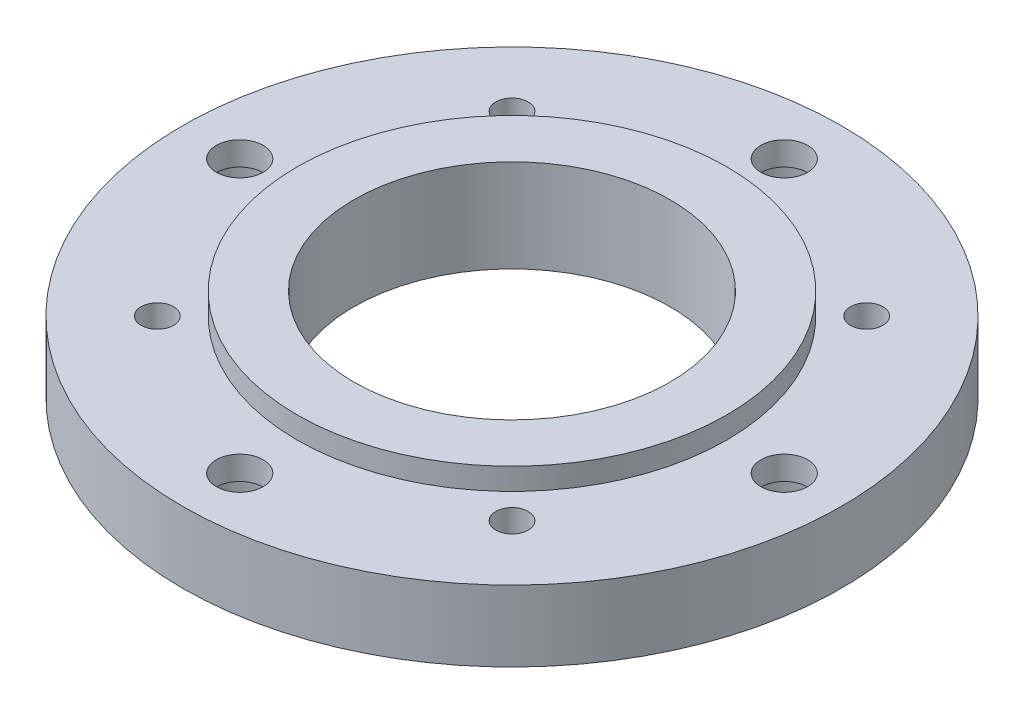
ISO-10303-21;
HEADER;
FILE_DESCRIPTION(('STEP AP214'),'2;1');
FILE_NAME('part.step','',(''),(''),'','','');
FILE_SCHEMA(('AUTOMOTIVE_DESIGN { 1 0 10303 214 1 1 1 1 }'));
ENDSEC;
DATA;
#1=APPLICATION_CONTEXT('core data for automotive mechanical design processes');
#2=APPLICATION_PROTOCOL_DEFINITION('international standard','automotive_design',2000,#1);
#3=PRODUCT_CONTEXT('',#1,'mechanical');
#4=PRODUCT('Part','Part','',(#3));
#5=PRODUCT_RELATED_PRODUCT_CATEGORY('part','',(#4));
#6=PRODUCT_DEFINITION_FORMATION('','',#4);
#7=PRODUCT_DEFINITION_CONTEXT('part definition',#1,'design');
#8=PRODUCT_DEFINITION('design','',#6,#7);
#9=PRODUCT_DEFINITION_SHAPE('','',#8);
#10=(LENGTH_UNIT() NAMED_UNIT(*) SI_UNIT(.MILLI.,.METRE.));
#11=(NAMED_UNIT(*) PLANE_ANGLE_UNIT() SI_UNIT($,.RADIAN.));
#12=(NAMED_UNIT(*) SI_UNIT($,.STERADIAN.) SOLID_ANGLE_UNIT());
#13=UNCERTAINTY_MEASURE_WITH_UNIT(LENGTH_MEASURE(1.E-05),#10,'distance_accuracy_value','');
#14=(GEOMETRIC_REPRESENTATION_CONTEXT(3) GLOBAL_UNCERTAINTY_ASSIGNED_CONTEXT((#13)) GLOBAL_UNIT_ASSIGNED_CONTEXT((#10,
#11,#12)) REPRESENTATION_CONTEXT('',''));
#15=CARTESIAN_POINT('',(0.,0.,0.));
#16=DIRECTION('',(0.,0.,1.));
#17=DIRECTION('',(1.,0.,0.));
#18=AXIS2_PLACEMENT_3D('',#15,#16,#17);
#19=CARTESIAN_POINT('',(0.,0.,0.));
#20=DIRECTION('',(0.,1.,0.));
#21=DIRECTION('',(0.,0.,1.));
#22=AXIS2_PLACEMENT_3D('',#19,#20,#21);
#23=PLANE('',#22);
#24=CARTESIAN_POINT('',(0.,0.,18.99));
#25=DIRECTION('',(0.,-1.,0.));
#26=DIRECTION('',(0.,0.,-1.));
#27=AXIS2_PLACEMENT_3D('',#24,#25,#26);
#28=CIRCLE('',#27,3.225000027);
#29=CARTESIAN_POINT('',(0.,0.,15.764999973));
#30=VERTEX_POINT('',#29);
#31=EDGE_CURVE('E497',#30,#30,#28,.T.);
#32=ORIENTED_EDGE('',*,*,#31,.F.);
#33=EDGE_LOOP('',(#32));
#34=FACE_BOUND('',#33,.T.);
#35=CARTESIAN_POINT('',(18.99,0.,0.));
#36=DIRECTION('',(0.,-1.,0.));
#37=DIRECTION('',(0.,0.,-1.));
#38=AXIS2_PLACEMENT_3D('',#35,#36,#37);
#39=CIRCLE('',#38,3.225000027);
#40=CARTESIAN_POINT('',(18.99,0.,-3.225000027));
#41=VERTEX_POINT('',#40);
#42=EDGE_CURVE('E108',#41,#41,#39,.T.);
#43=ORIENTED_EDGE('',*,*,#42,.F.);
#44=EDGE_LOOP('',(#43));
#45=FACE_BOUND('',#44,.T.);
#46=CARTESIAN_POINT('',(0.,0.,-18.99));
#47=DIRECTION('',(0.,-1.,0.));
#48=DIRECTION('',(0.,0.,-1.));
#49=AXIS2_PLACEMENT_3D('',#46,#47,#48);
#50=CIRCLE('',#49,3.225000027);
#51=CARTESIAN_POINT('',(0.,0.,-22.215000027));
#52=VERTEX_POINT('',#51);
#53=EDGE_CURVE('E92',#52,#52,#50,.T.);
#54=ORIENTED_EDGE('',*,*,#53,.F.);
#55=EDGE_LOOP('',(#54));
#56=FACE_BOUND('',#55,.T.);
#57=CARTESIAN_POINT('',(0.,0.,0.));
#58=DIRECTION('',(0.,1.,0.));
#59=DIRECTION('',(0.,0.,1.));
#60=AXIS2_PLACEMENT_3D('',#57,#58,#59);
#61=CIRCLE('',#60,11.025);
#62=CARTESIAN_POINT('',(0.,0.,11.025));
#63=VERTEX_POINT('',#62);
#64=EDGE_CURVE('E62',#63,#63,#61,.T.);
#65=ORIENTED_EDGE('',*,*,#64,.T.);
#66=EDGE_LOOP('',(#65));
#67=FACE_BOUND('',#66,.T.);
#68=CARTESIAN_POINT('',(0.,0.,0.));
#69=DIRECTION('',(0.,1.,0.));
#70=DIRECTION('',(0.,0.,1.));
#71=AXIS2_PLACEMENT_3D('',#68,#69,#70);
#72=CIRCLE('',#71,22.985);
#73=CARTESIAN_POINT('',(0.,0.,22.985));
#74=VERTEX_POINT('',#73);
#75=EDGE_CURVE('E68',#74,#74,#72,.T.);
#76=ORIENTED_EDGE('',*,*,#75,.F.);
#77=EDGE_LOOP('',(#76));
#78=FACE_BOUND('',#77,.T.);
#79=CARTESIAN_POINT('',(-12.3672976029527,0.,-12.3672976029527));
#80=DIRECTION('',(0.,1.,0.));
#81=DIRECTION('',(0.,0.,1.));
#82=AXIS2_PLACEMENT_3D('',#79,#80,#81);
#83=CIRCLE('',#82,1.1303);
#84=CARTESIAN_POINT('',(-12.3672976029527,0.,-11.2369976029527));
#85=VERTEX_POINT('',#84);
#86=EDGE_CURVE('E155',#85,#85,#83,.T.);
#87=ORIENTED_EDGE('',*,*,#86,.T.);
#88=EDGE_LOOP('',(#87));
#89=FACE_BOUND('',#88,.T.);
#90=CARTESIAN_POINT('',(-12.3672976029527,0.,12.3672976029527));
#91=DIRECTION('',(0.,1.,0.));
#92=DIRECTION('',(0.,0.,1.));
#93=AXIS2_PLACEMENT_3D('',#90,#91,#92);
#94=CIRCLE('',#93,1.1303);
#95=CARTESIAN_POINT('',(-12.3672976029527,0.,13.4975976029527));
#96=VERTEX_POINT('',#95);
#97=EDGE_CURVE('E147',#96,#96,#94,.T.);
#98=ORIENTED_EDGE('',*,*,#97,.T.);
#99=EDGE_LOOP('',(#98));
#100=FACE_BOUND('',#99,.T.);
#101=CARTESIAN_POINT('',(12.3672976029527,0.,12.3672976029527));
#102=DIRECTION('',(0.,1.,0.));
#103=DIRECTION('',(0.,0.,1.));
#104=AXIS2_PLACEMENT_3D('',#101,#102,#103);
#105=CIRCLE('',#104,1.1303);
#106=CARTESIAN_POINT('',(12.3672976029527,0.,13.4975976029527));
#107=VERTEX_POINT('',#106);
#108=EDGE_CURVE('E139',#107,#107,#105,.T.);
#109=ORIENTED_EDGE('',*,*,#108,.T.);
#110=EDGE_LOOP('',(#109));
#111=FACE_BOUND('',#110,.T.);
#112=CARTESIAN_POINT('',(12.3672976029527,0.,-12.3672976029527));
#113=DIRECTION('',(0.,1.,0.));
#114=DIRECTION('',(0.,0.,1.));
#115=AXIS2_PLACEMENT_3D('',#112,#113,#114);
#116=CIRCLE('',#115,1.1303);
#117=CARTESIAN_POINT('',(12.3672976029527,0.,-11.2369976029527));
#118=VERTEX_POINT('',#117);
#119=EDGE_CURVE('E131',#118,#118,#116,.T.);
#120=ORIENTED_EDGE('',*,*,#119,.T.);
#121=EDGE_LOOP('',(#120));
#122=FACE_BOUND('',#121,.T.);
#123=CARTESIAN_POINT('',(-18.99,0.,0.));
#124=DIRECTION('',(0.,-1.,0.));
#125=DIRECTION('',(0.,0.,-1.));
#126=AXIS2_PLACEMENT_3D('',#123,#124,#125);
#127=CIRCLE('',#126,3.225000027);
#128=CARTESIAN_POINT('',(-18.99,0.,-3.22500002699999));
#129=VERTEX_POINT('',#128);
#130=EDGE_CURVE('E87',#129,#129,#127,.T.);
#131=ORIENTED_EDGE('',*,*,#130,.F.);
#132=EDGE_LOOP('',(#131));
#133=FACE_BOUND('',#132,.T.);
#134=ADVANCED_FACE('F53',(#34,#45,#56,#67,#78,#89,#100,#111,#122,#133),#23,.F.);
#135=CARTESIAN_POINT('',(0.,4.95,0.));
#136=DIRECTION('',(0.,1.,0.));
#137=DIRECTION('',(0.,0.,1.));
#138=AXIS2_PLACEMENT_3D('',#135,#136,#137);
#139=PLANE('',#138);
#140=CARTESIAN_POINT('',(0.,4.95,18.99));
#141=DIRECTION('',(0.,1.,0.));
#142=DIRECTION('',(0.,0.,1.));
#143=AXIS2_PLACEMENT_3D('',#140,#141,#142);
#144=CIRCLE('',#143,1.63195);
#145=CARTESIAN_POINT('',(0.,4.95,20.62195));
#146=VERTEX_POINT('',#145);
#147=EDGE_CURVE('E57',#146,#146,#144,.T.);
#148=ORIENTED_EDGE('',*,*,#147,.F.);
#149=EDGE_LOOP('',(#148));
#150=FACE_BOUND('',#149,.T.);
#151=CARTESIAN_POINT('',(18.99,4.95,0.));
#152=DIRECTION('',(0.,1.,0.));
#153=DIRECTION('',(0.,0.,1.));
#154=AXIS2_PLACEMENT_3D('',#151,#152,#153);
#155=CIRCLE('',#154,1.63195);
#156=CARTESIAN_POINT('',(18.99,4.95,1.63195));
#157=VERTEX_POINT('',#156);
#158=EDGE_CURVE('E89',#157,#157,#155,.T.);
#159=ORIENTED_EDGE('',*,*,#158,.F.);
#160=EDGE_LOOP('',(#159));
#161=FACE_BOUND('',#160,.T.);
#162=CARTESIAN_POINT('',(0.,4.95,-18.99));
#163=DIRECTION('',(0.,1.,0.));
#164=DIRECTION('',(0.,0.,1.));
#165=AXIS2_PLACEMENT_3D('',#162,#163,#164);
#166=CIRCLE('',#165,1.63195);
#167=CARTESIAN_POINT('',(0.,4.95,-17.35805));
#168=VERTEX_POINT('',#167);
#169=EDGE_CURVE('E84',#168,#168,#166,.T.);
#170=ORIENTED_EDGE('',*,*,#169,.F.);
#171=EDGE_LOOP('',(#170));
#172=FACE_BOUND('',#171,.T.);
#173=CARTESIAN_POINT('',(-18.99,4.95,0.));
#174=DIRECTION('',(0.,1.,0.));
#175=DIRECTION('',(0.,0.,1.));
#176=AXIS2_PLACEMENT_3D('',#173,#174,#175);
#177=CIRCLE('',#176,1.63195);
#178=CARTESIAN_POINT('',(-18.99,4.95,1.63195));
#179=VERTEX_POINT('',#178);
#180=EDGE_CURVE('E78',#179,#179,#177,.T.);
#181=ORIENTED_EDGE('',*,*,#180,.F.);
#182=EDGE_LOOP('',(#181));
#183=FACE_BOUND('',#182,.T.);
#184=CARTESIAN_POINT('',(12.3672976029527,4.95,-12.3672976029527));
#185=DIRECTION('',(0.,1.,0.));
#186=DIRECTION('',(0.,0.,1.));
#187=AXIS2_PLACEMENT_3D('',#184,#185,#186);
#188=CIRCLE('',#187,1.1303);
#189=CARTESIAN_POINT('',(12.3672976029527,4.95,-11.2369976029527));
#190=VERTEX_POINT('',#189);
#191=EDGE_CURVE('E82',#190,#190,#188,.T.);
#192=ORIENTED_EDGE('',*,*,#191,.F.);
#193=EDGE_LOOP('',(#192));
#194=FACE_BOUND('',#193,.T.);
#195=CARTESIAN_POINT('',(12.3672976029527,4.95,12.3672976029527));
#196=DIRECTION('',(0.,1.,0.));
#197=DIRECTION('',(0.,0.,1.));
#198=AXIS2_PLACEMENT_3D('',#195,#196,#197);
#199=CIRCLE('',#198,1.1303);
#200=CARTESIAN_POINT('',(12.3672976029527,4.95,13.4975976029527));
#201=VERTEX_POINT('',#200);
#202=EDGE_CURVE('E135',#201,#201,#199,.T.);
#203=ORIENTED_EDGE('',*,*,#202,.F.);
#204=EDGE_LOOP('',(#203));
#205=FACE_BOUND('',#204,.T.);
#206=CARTESIAN_POINT('',(-12.3672976029527,4.95,12.3672976029527));
#207=DIRECTION('',(0.,1.,0.));
#208=DIRECTION('',(0.,0.,1.));
#209=AXIS2_PLACEMENT_3D('',#206,#207,#208);
#210=CIRCLE('',#209,1.1303);
#211=CARTESIAN_POINT('',(-12.3672976029527,4.95,13.4975976029527));
#212=VERTEX_POINT('',#211);
#213=EDGE_CURVE('E143',#212,#212,#210,.T.);
#214=ORIENTED_EDGE('',*,*,#213,.F.);
#215=EDGE_LOOP('',(#214));
#216=FACE_BOUND('',#215,.T.);
#217=CARTESIAN_POINT('',(-12.3672976029527,4.95,-12.3672976029527));
#218=DIRECTION('',(0.,1.,0.));
#219=DIRECTION('',(0.,0.,1.));
#220=AXIS2_PLACEMENT_3D('',#217,#218,#219);
#221=CIRCLE('',#220,1.1303);
#222=CARTESIAN_POINT('',(-12.3672976029527,4.95,-11.2369976029527));
#223=VERTEX_POINT('',#222);
#224=EDGE_CURVE('E151',#223,#223,#221,.T.);
#225=ORIENTED_EDGE('',*,*,#224,.F.);
#226=EDGE_LOOP('',(#225));
#227=FACE_BOUND('',#226,.T.);
#228=CARTESIAN_POINT('',(0.,4.95,0.));
#229=DIRECTION('',(0.,1.,0.));
#230=DIRECTION('',(0.,0.,1.));
#231=AXIS2_PLACEMENT_3D('',#228,#229,#230);
#232=CIRCLE('',#231,22.985);
#233=CARTESIAN_POINT('',(0.,4.95,22.985));
#234=VERTEX_POINT('',#233);
#235=EDGE_CURVE('E11',#234,#234,#232,.T.);
#236=ORIENTED_EDGE('',*,*,#235,.T.);
#237=EDGE_LOOP('',(#236));
#238=FACE_BOUND('',#237,.T.);
#239=CARTESIAN_POINT('',(0.,4.95,0.));
#240=DIRECTION('',(0.,1.,0.));
#241=DIRECTION('',(0.,0.,1.));
#242=AXIS2_PLACEMENT_3D('',#239,#240,#241);
#243=CIRCLE('',#242,14.985);
#244=CARTESIAN_POINT('',(0.,4.95,14.985));
#245=VERTEX_POINT('',#244);
#246=EDGE_CURVE('E72',#245,#245,#243,.T.);
#247=ORIENTED_EDGE('',*,*,#246,.F.);
#248=EDGE_LOOP('',(#247));
#249=FACE_BOUND('',#248,.T.);
#250=ADVANCED_FACE('F172',(#150,#161,#172,#183,#194,#205,#216,#227,#238,#249),#139,.T.);
#251=CARTESIAN_POINT('',(0.,4.95,0.));
#252=DIRECTION('',(0.,-1.,0.));
#253=DIRECTION('',(0.,0.,-1.));
#254=AXIS2_PLACEMENT_3D('',#251,#252,#253);
#255=CYLINDRICAL_SURFACE('',#254,22.985);
#256=ORIENTED_EDGE('',*,*,#235,.F.);
#257=EDGE_LOOP('',(#256));
#258=FACE_BOUND('',#257,.T.);
#259=ORIENTED_EDGE('',*,*,#75,.T.);
#260=EDGE_LOOP('',(#259));
#261=FACE_BOUND('',#260,.T.);
#262=ADVANCED_FACE('F55',(#258,#261),#255,.T.);
#263=CARTESIAN_POINT('',(0.,4.95,0.));
#264=DIRECTION('',(0.,-1.,0.));
#265=DIRECTION('',(0.,0.,-1.));
#266=AXIS2_PLACEMENT_3D('',#263,#264,#265);
#267=CYLINDRICAL_SURFACE('',#266,11.025);
#268=ORIENTED_EDGE('',*,*,#64,.F.);
#269=EDGE_LOOP('',(#268));
#270=FACE_BOUND('',#269,.T.);
#271=CARTESIAN_POINT('',(0.,6.47,0.));
#272=DIRECTION('',(0.,1.,0.));
#273=DIRECTION('',(0.,0.,1.));
#274=AXIS2_PLACEMENT_3D('',#271,#272,#273);
#275=CIRCLE('',#274,11.025);
#276=CARTESIAN_POINT('',(0.,6.47,11.025));
#277=VERTEX_POINT('',#276);
#278=EDGE_CURVE('E159',#277,#277,#275,.T.);
#279=ORIENTED_EDGE('',*,*,#278,.T.);
#280=EDGE_LOOP('',(#279));
#281=FACE_BOUND('',#280,.T.);
#282=ADVANCED_FACE('F180',(#270,#281),#267,.F.);
#283=CARTESIAN_POINT('',(0.,6.47,0.));
#284=DIRECTION('',(0.,1.,0.));
#285=DIRECTION('',(0.,0.,1.));
#286=AXIS2_PLACEMENT_3D('',#283,#284,#285);
#287=PLANE('',#286);
#288=CARTESIAN_POINT('',(0.,6.47,0.));
#289=DIRECTION('',(0.,1.,0.));
#290=DIRECTION('',(0.,0.,1.));
#291=AXIS2_PLACEMENT_3D('',#288,#289,#290);
#292=CIRCLE('',#291,14.985);
#293=CARTESIAN_POINT('',(0.,6.47,14.985));
#294=VERTEX_POINT('',#293);
#295=EDGE_CURVE('E76',#294,#294,#292,.T.);
#296=ORIENTED_EDGE('',*,*,#295,.T.);
#297=EDGE_LOOP('',(#296));
#298=FACE_BOUND('',#297,.T.);
#299=ORIENTED_EDGE('',*,*,#278,.F.);
#300=EDGE_LOOP('',(#299));
#301=FACE_BOUND('',#300,.T.);
#302=ADVANCED_FACE('F189',(#298,#301),#287,.T.);
#303=CARTESIAN_POINT('',(0.,6.47,0.));
#304=DIRECTION('',(0.,-1.,0.));
#305=DIRECTION('',(0.,0.,-1.));
#306=AXIS2_PLACEMENT_3D('',#303,#304,#305);
#307=CYLINDRICAL_SURFACE('',#306,14.985);
#308=ORIENTED_EDGE('',*,*,#295,.F.);
#309=EDGE_LOOP('',(#308));
#310=FACE_BOUND('',#309,.T.);
#311=ORIENTED_EDGE('',*,*,#246,.T.);
#312=EDGE_LOOP('',(#311));
#313=FACE_BOUND('',#312,.T.);
#314=ADVANCED_FACE('F170',(#310,#313),#307,.T.);
#315=CARTESIAN_POINT('',(-12.3672976029527,4.95,-12.3672976029527));
#316=DIRECTION('',(0.,1.,0.));
#317=DIRECTION('',(0.,0.,1.));
#318=AXIS2_PLACEMENT_3D('',#315,#316,#317);
#319=CYLINDRICAL_SURFACE('',#318,1.1303);
#320=ORIENTED_EDGE('',*,*,#86,.F.);
#321=EDGE_LOOP('',(#320));
#322=FACE_BOUND('',#321,.T.);
#323=ORIENTED_EDGE('',*,*,#224,.T.);
#324=EDGE_LOOP('',(#323));
#325=FACE_BOUND('',#324,.T.);
#326=ADVANCED_FACE('F245',(#322,#325),#319,.F.);
#327=CARTESIAN_POINT('',(-12.3672976029527,4.95,12.3672976029527));
#328=DIRECTION('',(0.,1.,0.));
#329=DIRECTION('',(0.,0.,1.));
#330=AXIS2_PLACEMENT_3D('',#327,#328,#329);
#331=CYLINDRICAL_SURFACE('',#330,1.1303);
#332=ORIENTED_EDGE('',*,*,#97,.F.);
#333=EDGE_LOOP('',(#332));
#334=FACE_BOUND('',#333,.T.);
#335=ORIENTED_EDGE('',*,*,#213,.T.);
#336=EDGE_LOOP('',(#335));
#337=FACE_BOUND('',#336,.T.);
#338=ADVANCED_FACE('F241',(#334,#337),#331,.F.);
#339=CARTESIAN_POINT('',(12.3672976029527,4.95,12.3672976029527));
#340=DIRECTION('',(0.,1.,0.));
#341=DIRECTION('',(0.,0.,1.));
#342=AXIS2_PLACEMENT_3D('',#339,#340,#341);
#343=CYLINDRICAL_SURFACE('',#342,1.1303);
#344=ORIENTED_EDGE('',*,*,#108,.F.);
#345=EDGE_LOOP('',(#344));
#346=FACE_BOUND('',#345,.T.);
#347=ORIENTED_EDGE('',*,*,#202,.T.);
#348=EDGE_LOOP('',(#347));
#349=FACE_BOUND('',#348,.T.);
#350=ADVANCED_FACE('F237',(#346,#349),#343,.F.);
#351=CARTESIAN_POINT('',(12.3672976029527,4.95,-12.3672976029527));
#352=DIRECTION('',(0.,1.,0.));
#353=DIRECTION('',(0.,0.,1.));
#354=AXIS2_PLACEMENT_3D('',#351,#352,#353);
#355=CYLINDRICAL_SURFACE('',#354,1.1303);
#356=ORIENTED_EDGE('',*,*,#119,.F.);
#357=EDGE_LOOP('',(#356));
#358=FACE_BOUND('',#357,.T.);
#359=ORIENTED_EDGE('',*,*,#191,.T.);
#360=EDGE_LOOP('',(#359));
#361=FACE_BOUND('',#360,.T.);
#362=ADVANCED_FACE('F233',(#358,#361),#355,.F.);
#363=CARTESIAN_POINT('',(-18.99,0.,0.));
#364=DIRECTION('',(0.,-1.,0.));
#365=DIRECTION('',(0.,0.,-1.));
#366=AXIS2_PLACEMENT_3D('',#363,#364,#365);
#367=CYLINDRICAL_SURFACE('',#366,1.63195);
#368=ORIENTED_EDGE('',*,*,#180,.T.);
#369=EDGE_LOOP('',(#368));
#370=FACE_BOUND('',#369,.T.);
#371=CARTESIAN_POINT('',(-18.99,3.300000004,0.));
#372=DIRECTION('',(0.,-1.,0.));
#373=DIRECTION('',(0.,0.,-1.));
#374=AXIS2_PLACEMENT_3D('',#371,#372,#373);
#375=CIRCLE('',#374,1.63195);
#376=CARTESIAN_POINT('',(-18.99,3.300000004,-1.63195));
#377=VERTEX_POINT('',#376);
#378=EDGE_CURVE('E83',#377,#377,#375,.T.);
#379=ORIENTED_EDGE('',*,*,#378,.T.);
#380=EDGE_LOOP('',(#379));
#381=FACE_BOUND('',#380,.T.);
#382=ADVANCED_FACE('F225',(#370,#381),#367,.F.);
#383=CARTESIAN_POINT('',(-17.35805,3.300000004,0.));
#384=DIRECTION('',(0.,1.,0.));
#385=DIRECTION('',(0.,0.,1.));
#386=AXIS2_PLACEMENT_3D('',#383,#384,#385);
#387=PLANE('',#386);
#388=ORIENTED_EDGE('',*,*,#378,.F.);
#389=EDGE_LOOP('',(#388));
#390=FACE_BOUND('',#389,.T.);
#391=CARTESIAN_POINT('',(-18.99,3.300000004,0.));
#392=DIRECTION('',(0.,-1.,0.));
#393=DIRECTION('',(0.,0.,-1.));
#394=AXIS2_PLACEMENT_3D('',#391,#392,#393);
#395=CIRCLE('',#394,3.225000027);
#396=CARTESIAN_POINT('',(-18.99,3.300000004,-3.22500002699999));
#397=VERTEX_POINT('',#396);
#398=EDGE_CURVE('E121',#397,#397,#395,.T.);
#399=ORIENTED_EDGE('',*,*,#398,.T.);
#400=EDGE_LOOP('',(#399));
#401=FACE_BOUND('',#400,.T.);
#402=ADVANCED_FACE('F215',(#390,#401),#387,.F.);
#403=CARTESIAN_POINT('',(-18.99,0.,0.));
#404=DIRECTION('',(0.,-1.,0.));
#405=DIRECTION('',(0.,0.,-1.));
#406=AXIS2_PLACEMENT_3D('',#403,#404,#405);
#407=CYLINDRICAL_SURFACE('',#406,3.225000027);
#408=ORIENTED_EDGE('',*,*,#398,.F.);
#409=EDGE_LOOP('',(#408));
#410=FACE_BOUND('',#409,.T.);
#411=ORIENTED_EDGE('',*,*,#130,.T.);
#412=EDGE_LOOP('',(#411));
#413=FACE_BOUND('',#412,.T.);
#414=ADVANCED_FACE('F212',(#410,#413),#407,.F.);
#415=CARTESIAN_POINT('',(0.,0.,-18.99));
#416=DIRECTION('',(0.,-1.,0.));
#417=DIRECTION('',(0.,0.,-1.));
#418=AXIS2_PLACEMENT_3D('',#415,#416,#417);
#419=CYLINDRICAL_SURFACE('',#418,1.63195);
#420=ORIENTED_EDGE('',*,*,#169,.T.);
#421=EDGE_LOOP('',(#420));
#422=FACE_BOUND('',#421,.T.);
#423=CARTESIAN_POINT('',(0.,3.300000004,-18.99));
#424=DIRECTION('',(0.,-1.,0.));
#425=DIRECTION('',(0.,0.,-1.));
#426=AXIS2_PLACEMENT_3D('',#423,#424,#425);
#427=CIRCLE('',#426,1.63195);
#428=CARTESIAN_POINT('',(0.,3.300000004,-20.62195));
#429=VERTEX_POINT('',#428);
#430=EDGE_CURVE('E88',#429,#429,#427,.T.);
#431=ORIENTED_EDGE('',*,*,#430,.T.);
#432=EDGE_LOOP('',(#431));
#433=FACE_BOUND('',#432,.T.);
#434=ADVANCED_FACE('F214',(#422,#433),#419,.F.);
#435=CARTESIAN_POINT('',(1.63195,3.300000004,-18.99));
#436=DIRECTION('',(0.,1.,0.));
#437=DIRECTION('',(0.,0.,1.));
#438=AXIS2_PLACEMENT_3D('',#435,#436,#437);
#439=PLANE('',#438);
#440=ORIENTED_EDGE('',*,*,#430,.F.);
#441=EDGE_LOOP('',(#440));
#442=FACE_BOUND('',#441,.T.);
#443=CARTESIAN_POINT('',(0.,3.300000004,-18.99));
#444=DIRECTION('',(0.,-1.,0.));
#445=DIRECTION('',(0.,0.,-1.));
#446=AXIS2_PLACEMENT_3D('',#443,#444,#445);
#447=CIRCLE('',#446,3.225000027);
#448=CARTESIAN_POINT('',(0.,3.300000004,-22.215000027));
#449=VERTEX_POINT('',#448);
#450=EDGE_CURVE('E99',#449,#449,#447,.T.);
#451=ORIENTED_EDGE('',*,*,#450,.T.);
#452=EDGE_LOOP('',(#451));
#453=FACE_BOUND('',#452,.T.);
#454=ADVANCED_FACE('F222',(#442,#453),#439,.F.);
#455=CARTESIAN_POINT('',(0.,0.,-18.99));
#456=DIRECTION('',(0.,-1.,0.));
#457=DIRECTION('',(0.,0.,-1.));
#458=AXIS2_PLACEMENT_3D('',#455,#456,#457);
#459=CYLINDRICAL_SURFACE('',#458,3.225000027);
#460=ORIENTED_EDGE('',*,*,#450,.F.);
#461=EDGE_LOOP('',(#460));
#462=FACE_BOUND('',#461,.T.);
#463=ORIENTED_EDGE('',*,*,#53,.T.);
#464=EDGE_LOOP('',(#463));
#465=FACE_BOUND('',#464,.T.);
#466=ADVANCED_FACE('F362',(#462,#465),#459,.F.);
#467=CARTESIAN_POINT('',(18.99,0.,0.));
#468=DIRECTION('',(0.,-1.,0.));
#469=DIRECTION('',(0.,0.,-1.));
#470=AXIS2_PLACEMENT_3D('',#467,#468,#469);
#471=CYLINDRICAL_SURFACE('',#470,1.63195);
#472=ORIENTED_EDGE('',*,*,#158,.T.);
#473=EDGE_LOOP('',(#472));
#474=FACE_BOUND('',#473,.T.);
#475=CARTESIAN_POINT('',(18.99,3.300000004,0.));
#476=DIRECTION('',(0.,-1.,0.));
#477=DIRECTION('',(0.,0.,-1.));
#478=AXIS2_PLACEMENT_3D('',#475,#476,#477);
#479=CIRCLE('',#478,1.63195);
#480=CARTESIAN_POINT('',(18.99,3.300000004,-1.63195));
#481=VERTEX_POINT('',#480);
#482=EDGE_CURVE('E93',#481,#481,#479,.T.);
#483=ORIENTED_EDGE('',*,*,#482,.T.);
#484=EDGE_LOOP('',(#483));
#485=FACE_BOUND('',#484,.T.);
#486=ADVANCED_FACE('F371',(#474,#485),#471,.F.);
#487=CARTESIAN_POINT('',(20.62195,3.300000004,0.));
#488=DIRECTION('',(0.,1.,0.));
#489=DIRECTION('',(0.,0.,1.));
#490=AXIS2_PLACEMENT_3D('',#487,#488,#489);
#491=PLANE('',#490);
#492=ORIENTED_EDGE('',*,*,#482,.F.);
#493=EDGE_LOOP('',(#492));
#494=FACE_BOUND('',#493,.T.);
#495=CARTESIAN_POINT('',(18.99,3.300000004,0.));
#496=DIRECTION('',(0.,-1.,0.));
#497=DIRECTION('',(0.,0.,-1.));
#498=AXIS2_PLACEMENT_3D('',#495,#496,#497);
#499=CIRCLE('',#498,3.225000027);
#500=CARTESIAN_POINT('',(18.99,3.300000004,-3.225000027));
#501=VERTEX_POINT('',#500);
#502=EDGE_CURVE('E102',#501,#501,#499,.T.);
#503=ORIENTED_EDGE('',*,*,#502,.T.);
#504=EDGE_LOOP('',(#503));
#505=FACE_BOUND('',#504,.T.);
#506=ADVANCED_FACE('F381',(#494,#505),#491,.F.);
#507=CARTESIAN_POINT('',(18.99,0.,0.));
#508=DIRECTION('',(0.,-1.,0.));
#509=DIRECTION('',(0.,0.,-1.));
#510=AXIS2_PLACEMENT_3D('',#507,#508,#509);
#511=CYLINDRICAL_SURFACE('',#510,3.225000027);
#512=ORIENTED_EDGE('',*,*,#502,.F.);
#513=EDGE_LOOP('',(#512));
#514=FACE_BOUND('',#513,.T.);
#515=ORIENTED_EDGE('',*,*,#42,.T.);
#516=EDGE_LOOP('',(#515));
#517=FACE_BOUND('',#516,.T.);
#518=ADVANCED_FACE('F390',(#514,#517),#511,.F.);
#519=CARTESIAN_POINT('',(0.,0.,18.99));
#520=DIRECTION('',(0.,-1.,0.));
#521=DIRECTION('',(0.,0.,-1.));
#522=AXIS2_PLACEMENT_3D('',#519,#520,#521);
#523=CYLINDRICAL_SURFACE('',#522,1.63195);
#524=ORIENTED_EDGE('',*,*,#147,.T.);
#525=EDGE_LOOP('',(#524));
#526=FACE_BOUND('',#525,.T.);
#527=CARTESIAN_POINT('',(0.,3.300000004,18.99));
#528=DIRECTION('',(0.,-1.,0.));
#529=DIRECTION('',(0.,0.,-1.));
#530=AXIS2_PLACEMENT_3D('',#527,#528,#529);
#531=CIRCLE('',#530,1.63195);
#532=CARTESIAN_POINT('',(0.,3.300000004,17.35805));
#533=VERTEX_POINT('',#532);
#534=EDGE_CURVE('E501',#533,#533,#531,.T.);
#535=ORIENTED_EDGE('',*,*,#534,.T.);
#536=EDGE_LOOP('',(#535));
#537=FACE_BOUND('',#536,.T.);
#538=ADVANCED_FACE('F400',(#526,#537),#523,.F.);
#539=CARTESIAN_POINT('',(1.63195,3.300000004,18.99));
#540=DIRECTION('',(0.,1.,0.));
#541=DIRECTION('',(0.,0.,1.));
#542=AXIS2_PLACEMENT_3D('',#539,#540,#541);
#543=PLANE('',#542);
#544=ORIENTED_EDGE('',*,*,#534,.F.);
#545=EDGE_LOOP('',(#544));
#546=FACE_BOUND('',#545,.T.);
#547=CARTESIAN_POINT('',(0.,3.300000004,18.99));
#548=DIRECTION('',(0.,-1.,0.));
#549=DIRECTION('',(0.,0.,-1.));
#550=AXIS2_PLACEMENT_3D('',#547,#548,#549);
#551=CIRCLE('',#550,3.225000027);
#552=CARTESIAN_POINT('',(0.,3.300000004,15.764999973));
#553=VERTEX_POINT('',#552);
#554=EDGE_CURVE('E494',#553,#553,#551,.T.);
#555=ORIENTED_EDGE('',*,*,#554,.T.);
#556=EDGE_LOOP('',(#555));
#557=FACE_BOUND('',#556,.T.);
#558=ADVANCED_FACE('F410',(#546,#557),#543,.F.);
#559=CARTESIAN_POINT('',(0.,0.,18.99));
#560=DIRECTION('',(0.,-1.,0.));
#561=DIRECTION('',(0.,0.,-1.));
#562=AXIS2_PLACEMENT_3D('',#559,#560,#561);
#563=CYLINDRICAL_SURFACE('',#562,3.225000027);
#564=ORIENTED_EDGE('',*,*,#554,.F.);
#565=EDGE_LOOP('',(#564));
#566=FACE_BOUND('',#565,.T.);
#567=ORIENTED_EDGE('',*,*,#31,.T.);
#568=EDGE_LOOP('',(#567));
#569=FACE_BOUND('',#568,.T.);
#570=ADVANCED_FACE('F420',(#566,#569),#563,.F.);
#571=CLOSED_SHELL('',(#134,#250,#262,#282,#302,#314,#326,#338,#350,#362,#382,#402,#414,#434,
#454,#466,#486,#506,#518,#538,#558,#570));
#572=MANIFOLD_SOLID_BREP('B2',#571);
#573=ADVANCED_BREP_SHAPE_REPRESENTATION('',(#18,#572),#14);
#574=SHAPE_DEFINITION_REPRESENTATION(#9,#573);
ENDSEC;
END-ISO-10303-21;
